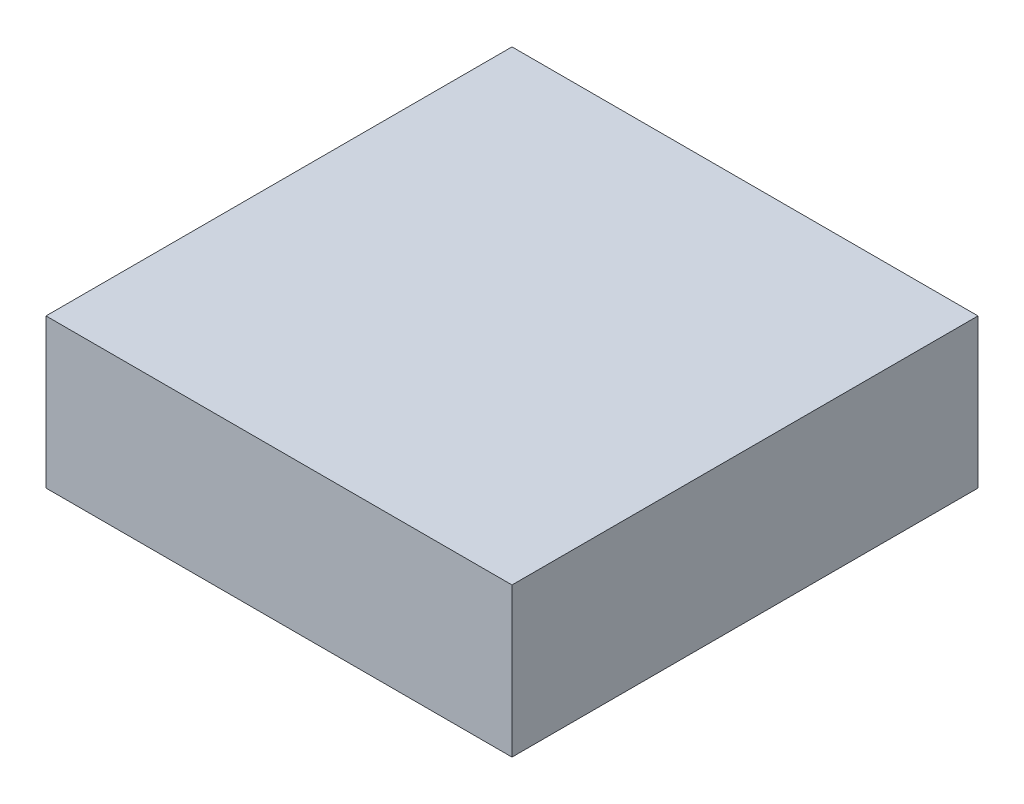
ISO-10303-21;
HEADER;
FILE_DESCRIPTION(('STEP AP214'),'2;1');
FILE_NAME('part.step','',(''),(''),'','','');
FILE_SCHEMA(('AUTOMOTIVE_DESIGN { 1 0 10303 214 1 1 1 1 }'));
ENDSEC;
DATA;
#1=APPLICATION_CONTEXT('core data for automotive mechanical design processes');
#2=APPLICATION_PROTOCOL_DEFINITION('international standard','automotive_design',2000,#1);
#3=PRODUCT_CONTEXT('',#1,'mechanical');
#4=PRODUCT('Part','Part','',(#3));
#5=PRODUCT_RELATED_PRODUCT_CATEGORY('part','',(#4));
#6=PRODUCT_DEFINITION_FORMATION('','',#4);
#7=PRODUCT_DEFINITION_CONTEXT('part definition',#1,'design');
#8=PRODUCT_DEFINITION('design','',#6,#7);
#9=PRODUCT_DEFINITION_SHAPE('','',#8);
#10=(LENGTH_UNIT() NAMED_UNIT(*) SI_UNIT(.MILLI.,.METRE.));
#11=(NAMED_UNIT(*) PLANE_ANGLE_UNIT() SI_UNIT($,.RADIAN.));
#12=(NAMED_UNIT(*) SI_UNIT($,.STERADIAN.) SOLID_ANGLE_UNIT());
#13=UNCERTAINTY_MEASURE_WITH_UNIT(LENGTH_MEASURE(1.E-05),#10,'distance_accuracy_value','');
#14=(GEOMETRIC_REPRESENTATION_CONTEXT(3) GLOBAL_UNCERTAINTY_ASSIGNED_CONTEXT((#13)) GLOBAL_UNIT_ASSIGNED_CONTEXT((#10,
#11,#12)) REPRESENTATION_CONTEXT('',''));
#15=CARTESIAN_POINT('',(0.,0.,0.));
#16=DIRECTION('',(0.,0.,1.));
#17=DIRECTION('',(1.,0.,0.));
#18=AXIS2_PLACEMENT_3D('',#15,#16,#17);
#19=CARTESIAN_POINT('',(1.25,0.8,-1.25));
#20=DIRECTION('',(-1.,0.,0.));
#21=DIRECTION('',(0.,0.,1.));
#22=AXIS2_PLACEMENT_3D('',#19,#20,#21);
#23=PLANE('',#22);
#24=DIRECTION('',(0.,0.,-1.));
#25=VECTOR('',#24,1.);
#26=CARTESIAN_POINT('',(1.25,0.,-1.25));
#27=LINE('',#26,#25);
#28=CARTESIAN_POINT('',(1.25,0.,1.25));
#29=VERTEX_POINT('',#28);
#30=CARTESIAN_POINT('',(1.25,0.,-1.25));
#31=VERTEX_POINT('',#30);
#32=EDGE_CURVE('E108',#29,#31,#27,.T.);
#33=ORIENTED_EDGE('',*,*,#32,.T.);
#34=DIRECTION('',(0.,-1.,0.));
#35=VECTOR('',#34,1.);
#36=CARTESIAN_POINT('',(1.25,0.8,-1.25));
#37=LINE('',#36,#35);
#38=CARTESIAN_POINT('',(1.25,0.8,-1.25));
#39=VERTEX_POINT('',#38);
#40=EDGE_CURVE('E11',#39,#31,#37,.T.);
#41=ORIENTED_EDGE('',*,*,#40,.F.);
#42=DIRECTION('',(0.,0.,-1.));
#43=VECTOR('',#42,1.);
#44=CARTESIAN_POINT('',(1.25,0.8,-1.25));
#45=LINE('',#44,#43);
#46=CARTESIAN_POINT('',(1.25,0.8,1.25));
#47=VERTEX_POINT('',#46);
#48=EDGE_CURVE('E96',#47,#39,#45,.T.);
#49=ORIENTED_EDGE('',*,*,#48,.F.);
#50=DIRECTION('',(0.,-1.,0.));
#51=VECTOR('',#50,1.);
#52=CARTESIAN_POINT('',(1.25,0.8,1.25));
#53=LINE('',#52,#51);
#54=EDGE_CURVE('E104',#47,#29,#53,.T.);
#55=ORIENTED_EDGE('',*,*,#54,.T.);
#56=EDGE_LOOP('',(#33,#41,#49,#55));
#57=FACE_BOUND('',#56,.T.);
#58=ADVANCED_FACE('F45',(#57),#23,.F.);
#59=CARTESIAN_POINT('',(-1.25,0.8,-1.25));
#60=DIRECTION('',(0.,0.,1.));
#61=DIRECTION('',(1.,0.,0.));
#62=AXIS2_PLACEMENT_3D('',#59,#60,#61);
#63=PLANE('',#62);
#64=DIRECTION('',(-1.,0.,0.));
#65=VECTOR('',#64,1.);
#66=CARTESIAN_POINT('',(-1.25,0.,-1.25));
#67=LINE('',#66,#65);
#68=CARTESIAN_POINT('',(-1.25,0.,-1.25));
#69=VERTEX_POINT('',#68);
#70=EDGE_CURVE('E100',#31,#69,#67,.T.);
#71=ORIENTED_EDGE('',*,*,#70,.T.);
#72=DIRECTION('',(0.,-1.,0.));
#73=VECTOR('',#72,1.);
#74=CARTESIAN_POINT('',(-1.25,0.8,-1.25));
#75=LINE('',#74,#73);
#76=CARTESIAN_POINT('',(-1.25,0.8,-1.25));
#77=VERTEX_POINT('',#76);
#78=EDGE_CURVE('E53',#77,#69,#75,.T.);
#79=ORIENTED_EDGE('',*,*,#78,.F.);
#80=DIRECTION('',(-1.,0.,0.));
#81=VECTOR('',#80,1.);
#82=CARTESIAN_POINT('',(-1.25,0.8,-1.25));
#83=LINE('',#82,#81);
#84=EDGE_CURVE('E91',#39,#77,#83,.T.);
#85=ORIENTED_EDGE('',*,*,#84,.F.);
#86=ORIENTED_EDGE('',*,*,#40,.T.);
#87=EDGE_LOOP('',(#71,#79,#85,#86));
#88=FACE_BOUND('',#87,.T.);
#89=ADVANCED_FACE('F99',(#88),#63,.F.);
#90=CARTESIAN_POINT('',(-1.25,0.8,-1.25));
#91=DIRECTION('',(1.,0.,0.));
#92=DIRECTION('',(0.,0.,-1.));
#93=AXIS2_PLACEMENT_3D('',#90,#91,#92);
#94=PLANE('',#93);
#95=DIRECTION('',(0.,0.,1.));
#96=VECTOR('',#95,1.);
#97=CARTESIAN_POINT('',(-1.25,0.,-1.25));
#98=LINE('',#97,#96);
#99=CARTESIAN_POINT('',(-1.25,0.,1.25));
#100=VERTEX_POINT('',#99);
#101=EDGE_CURVE('E78',#69,#100,#98,.T.);
#102=ORIENTED_EDGE('',*,*,#101,.T.);
#103=DIRECTION('',(0.,-1.,0.));
#104=VECTOR('',#103,1.);
#105=CARTESIAN_POINT('',(-1.25,0.8,1.25));
#106=LINE('',#105,#104);
#107=CARTESIAN_POINT('',(-1.25,0.8,1.25));
#108=VERTEX_POINT('',#107);
#109=EDGE_CURVE('E101',#108,#100,#106,.T.);
#110=ORIENTED_EDGE('',*,*,#109,.F.);
#111=DIRECTION('',(0.,0.,1.));
#112=VECTOR('',#111,1.);
#113=CARTESIAN_POINT('',(-1.25,0.8,-1.25));
#114=LINE('',#113,#112);
#115=EDGE_CURVE('E94',#77,#108,#114,.T.);
#116=ORIENTED_EDGE('',*,*,#115,.F.);
#117=ORIENTED_EDGE('',*,*,#78,.T.);
#118=EDGE_LOOP('',(#102,#110,#116,#117));
#119=FACE_BOUND('',#118,.T.);
#120=ADVANCED_FACE('F102',(#119),#94,.F.);
#121=CARTESIAN_POINT('',(-1.25,0.8,1.25));
#122=DIRECTION('',(0.,0.,-1.));
#123=DIRECTION('',(-1.,0.,0.));
#124=AXIS2_PLACEMENT_3D('',#121,#122,#123);
#125=PLANE('',#124);
#126=DIRECTION('',(1.,0.,0.));
#127=VECTOR('',#126,1.);
#128=CARTESIAN_POINT('',(-1.25,0.,1.25));
#129=LINE('',#128,#127);
#130=EDGE_CURVE('E84',#100,#29,#129,.T.);
#131=ORIENTED_EDGE('',*,*,#130,.T.);
#132=ORIENTED_EDGE('',*,*,#54,.F.);
#133=DIRECTION('',(1.,0.,0.));
#134=VECTOR('',#133,1.);
#135=CARTESIAN_POINT('',(-1.25,0.8,1.25));
#136=LINE('',#135,#134);
#137=EDGE_CURVE('E61',#108,#47,#136,.T.);
#138=ORIENTED_EDGE('',*,*,#137,.F.);
#139=ORIENTED_EDGE('',*,*,#109,.T.);
#140=EDGE_LOOP('',(#131,#132,#138,#139));
#141=FACE_BOUND('',#140,.T.);
#142=ADVANCED_FACE('F115',(#141),#125,.F.);
#143=CARTESIAN_POINT('',(0.,0.8,0.));
#144=DIRECTION('',(0.,1.,0.));
#145=DIRECTION('',(0.,0.,1.));
#146=AXIS2_PLACEMENT_3D('',#143,#144,#145);
#147=PLANE('',#146);
#148=ORIENTED_EDGE('',*,*,#48,.T.);
#149=ORIENTED_EDGE('',*,*,#84,.T.);
#150=ORIENTED_EDGE('',*,*,#115,.T.);
#151=ORIENTED_EDGE('',*,*,#137,.T.);
#152=EDGE_LOOP('',(#148,#149,#150,#151));
#153=FACE_BOUND('',#152,.T.);
#154=ADVANCED_FACE('F92',(#153),#147,.T.);
#155=CARTESIAN_POINT('',(0.,0.,0.));
#156=DIRECTION('',(0.,1.,0.));
#157=DIRECTION('',(0.,0.,1.));
#158=AXIS2_PLACEMENT_3D('',#155,#156,#157);
#159=PLANE('',#158);
#160=ORIENTED_EDGE('',*,*,#32,.F.);
#161=ORIENTED_EDGE('',*,*,#130,.F.);
#162=ORIENTED_EDGE('',*,*,#101,.F.);
#163=ORIENTED_EDGE('',*,*,#70,.F.);
#164=EDGE_LOOP('',(#160,#161,#162,#163));
#165=FACE_BOUND('',#164,.T.);
#166=ADVANCED_FACE('F118',(#165),#159,.F.);
#167=CLOSED_SHELL('',(#58,#89,#120,#142,#154,#166));
#168=MANIFOLD_SOLID_BREP('B2',#167);
#169=ADVANCED_BREP_SHAPE_REPRESENTATION('',(#18,#168),#14);
#170=SHAPE_DEFINITION_REPRESENTATION(#9,#169);
ENDSEC;
END-ISO-10303-21;
